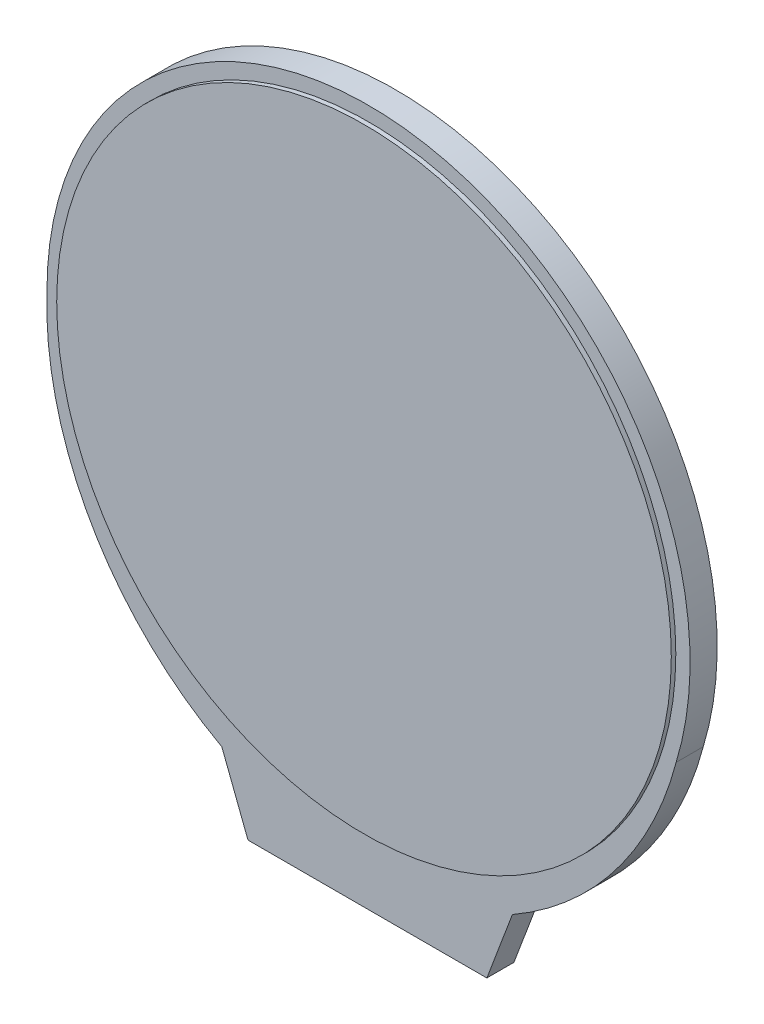
ISO-10303-21;
HEADER;
FILE_DESCRIPTION(('STEP AP214'),'2;1');
FILE_NAME('part.step','',(''),(''),'','','');
FILE_SCHEMA(('AUTOMOTIVE_DESIGN { 1 0 10303 214 1 1 1 1 }'));
ENDSEC;
DATA;
#1=APPLICATION_CONTEXT('core data for automotive mechanical design processes');
#2=APPLICATION_PROTOCOL_DEFINITION('international standard','automotive_design',2000,#1);
#3=PRODUCT_CONTEXT('',#1,'mechanical');
#4=PRODUCT('Part','Part','',(#3));
#5=PRODUCT_RELATED_PRODUCT_CATEGORY('part','',(#4));
#6=PRODUCT_DEFINITION_FORMATION('','',#4);
#7=PRODUCT_DEFINITION_CONTEXT('part definition',#1,'design');
#8=PRODUCT_DEFINITION('design','',#6,#7);
#9=PRODUCT_DEFINITION_SHAPE('','',#8);
#10=(LENGTH_UNIT() NAMED_UNIT(*) SI_UNIT(.MILLI.,.METRE.));
#11=(NAMED_UNIT(*) PLANE_ANGLE_UNIT() SI_UNIT($,.RADIAN.));
#12=(NAMED_UNIT(*) SI_UNIT($,.STERADIAN.) SOLID_ANGLE_UNIT());
#13=UNCERTAINTY_MEASURE_WITH_UNIT(LENGTH_MEASURE(1.E-05),#10,'distance_accuracy_value','');
#14=(GEOMETRIC_REPRESENTATION_CONTEXT(3) GLOBAL_UNCERTAINTY_ASSIGNED_CONTEXT((#13)) GLOBAL_UNIT_ASSIGNED_CONTEXT((#10,
#11,#12)) REPRESENTATION_CONTEXT('',''));
#15=CARTESIAN_POINT('',(0.,0.,0.));
#16=DIRECTION('',(0.,0.,1.));
#17=DIRECTION('',(1.,0.,0.));
#18=AXIS2_PLACEMENT_3D('',#15,#16,#17);
#19=CARTESIAN_POINT('',(-6.59561344745727,-15.5109133790262,-0.25));
#20=DIRECTION('',(-1.,0.,0.));
#21=DIRECTION('',(0.,0.,1.));
#22=AXIS2_PLACEMENT_3D('',#19,#20,#21);
#23=PLANE('',#22);
#24=DIRECTION('',(0.,-1.,0.));
#25=VECTOR('',#24,1.);
#26=CARTESIAN_POINT('',(-6.59561344745727,-15.5109133790262,0.));
#27=LINE('',#26,#25);
#28=CARTESIAN_POINT('',(-6.59561344745727,-8.88871303851563,0.));
#29=VERTEX_POINT('',#28);
#30=CARTESIAN_POINT('',(-6.59561344745727,-15.5109133790262,0.));
#31=VERTEX_POINT('',#30);
#32=EDGE_CURVE('E227',#29,#31,#27,.T.);
#33=ORIENTED_EDGE('',*,*,#32,.F.);
#34=DIRECTION('',(0.,0.,1.));
#35=VECTOR('',#34,1.);
#36=CARTESIAN_POINT('',(-6.59561344745727,-8.88871303851563,-0.25));
#37=LINE('',#36,#35);
#38=CARTESIAN_POINT('',(-6.59561344745727,-8.88871303851563,-0.25));
#39=VERTEX_POINT('',#38);
#40=EDGE_CURVE('E43',#39,#29,#37,.T.);
#41=ORIENTED_EDGE('',*,*,#40,.F.);
#42=DIRECTION('',(0.,-1.,0.));
#43=VECTOR('',#42,1.);
#44=CARTESIAN_POINT('',(-6.59561344745727,-15.5109133790262,-0.25));
#45=LINE('',#44,#43);
#46=CARTESIAN_POINT('',(-6.59561344745727,-15.5109133790262,-0.25));
#47=VERTEX_POINT('',#46);
#48=EDGE_CURVE('E229',#39,#47,#45,.T.);
#49=ORIENTED_EDGE('',*,*,#48,.T.);
#50=DIRECTION('',(0.,0.,1.));
#51=VECTOR('',#50,1.);
#52=CARTESIAN_POINT('',(-6.59561344745727,-15.5109133790262,-0.25));
#53=LINE('',#52,#51);
#54=EDGE_CURVE('E38',#47,#31,#53,.T.);
#55=ORIENTED_EDGE('',*,*,#54,.T.);
#56=EDGE_LOOP('',(#33,#41,#49,#55));
#57=FACE_BOUND('',#56,.T.);
#58=ADVANCED_FACE('F35',(#57),#23,.T.);
#59=CARTESIAN_POINT('',(-6.59561344745727,-8.88871303851563,-0.25));
#60=DIRECTION('',(-0.819117480335174,0.573625795627565,0.));
#61=DIRECTION('',(-0.573625795627565,-0.819117480335174,0.));
#62=AXIS2_PLACEMENT_3D('',#59,#60,#61);
#63=PLANE('',#62);
#64=DIRECTION('',(-0.573625795627565,-0.819117480335174,0.));
#65=VECTOR('',#64,1.);
#66=CARTESIAN_POINT('',(-6.59561344745727,-8.88871303851563,0.));
#67=LINE('',#66,#65);
#68=CARTESIAN_POINT('',(-5.61537471162003,-7.48896656695484,0.));
#69=VERTEX_POINT('',#68);
#70=EDGE_CURVE('E233',#69,#29,#67,.T.);
#71=ORIENTED_EDGE('',*,*,#70,.F.);
#72=DIRECTION('',(0.,0.,1.));
#73=VECTOR('',#72,1.);
#74=CARTESIAN_POINT('',(-5.61537471162003,-7.48896656695484,-0.25));
#75=LINE('',#74,#73);
#76=CARTESIAN_POINT('',(-5.61537471162003,-7.48896656695484,-0.25));
#77=VERTEX_POINT('',#76);
#78=EDGE_CURVE('E274',#77,#69,#75,.T.);
#79=ORIENTED_EDGE('',*,*,#78,.F.);
#80=DIRECTION('',(-0.573625795627565,-0.819117480335174,0.));
#81=VECTOR('',#80,1.);
#82=CARTESIAN_POINT('',(-6.59561344745727,-8.88871303851563,-0.25));
#83=LINE('',#82,#81);
#84=EDGE_CURVE('E251',#77,#39,#83,.T.);
#85=ORIENTED_EDGE('',*,*,#84,.T.);
#86=ORIENTED_EDGE('',*,*,#40,.T.);
#87=EDGE_LOOP('',(#71,#79,#85,#86));
#88=FACE_BOUND('',#87,.T.);
#89=ADVANCED_FACE('F356',(#88),#63,.T.);
#90=CARTESIAN_POINT('',(-5.61537471162003,-7.48896656695484,-0.25));
#91=DIRECTION('',(-1.,0.,0.));
#92=DIRECTION('',(0.,0.,1.));
#93=AXIS2_PLACEMENT_3D('',#90,#91,#92);
#94=PLANE('',#93);
#95=DIRECTION('',(0.,-1.,0.));
#96=VECTOR('',#95,1.);
#97=CARTESIAN_POINT('',(-5.61537471162003,-7.48896656695484,0.));
#98=LINE('',#97,#96);
#99=CARTESIAN_POINT('',(-5.61537471162003,-5.38388285599448,0.));
#100=VERTEX_POINT('',#99);
#101=EDGE_CURVE('E268',#100,#69,#98,.T.);
#102=ORIENTED_EDGE('',*,*,#101,.F.);
#103=DIRECTION('',(0.,0.,1.));
#104=VECTOR('',#103,1.);
#105=CARTESIAN_POINT('',(-5.61537471162003,-5.38388285599448,-0.25));
#106=LINE('',#105,#104);
#107=CARTESIAN_POINT('',(-5.61537471162003,-5.38388285599448,-0.25));
#108=VERTEX_POINT('',#107);
#109=EDGE_CURVE('E276',#108,#100,#106,.T.);
#110=ORIENTED_EDGE('',*,*,#109,.F.);
#111=DIRECTION('',(0.,-1.,0.));
#112=VECTOR('',#111,1.);
#113=CARTESIAN_POINT('',(-5.61537471162003,-7.48896656695484,-0.25));
#114=LINE('',#113,#112);
#115=EDGE_CURVE('E248',#108,#77,#114,.T.);
#116=ORIENTED_EDGE('',*,*,#115,.T.);
#117=ORIENTED_EDGE('',*,*,#78,.T.);
#118=EDGE_LOOP('',(#102,#110,#116,#117));
#119=FACE_BOUND('',#118,.T.);
#120=ADVANCED_FACE('F360',(#119),#94,.T.);
#121=CARTESIAN_POINT('',(-5.11537471162003,-5.38388285599448,-0.25));
#122=DIRECTION('',(0.,0.,1.));
#123=DIRECTION('',(1.,0.,0.));
#124=AXIS2_PLACEMENT_3D('',#121,#122,#123);
#125=CYLINDRICAL_SURFACE('',#124,0.5);
#126=CARTESIAN_POINT('',(-5.11537471162003,-5.38388285599448,0.));
#127=DIRECTION('',(0.,0.,1.));
#128=DIRECTION('',(-1.,0.,0.));
#129=AXIS2_PLACEMENT_3D('',#126,#127,#128);
#130=CIRCLE('',#129,0.5);
#131=CARTESIAN_POINT('',(-5.11537471162003,-4.88388285599448,0.));
#132=VERTEX_POINT('',#131);
#133=EDGE_CURVE('E265',#132,#100,#130,.T.);
#134=ORIENTED_EDGE('',*,*,#133,.F.);
#135=DIRECTION('',(0.,0.,1.));
#136=VECTOR('',#135,1.);
#137=CARTESIAN_POINT('',(-5.11537471162003,-4.88388285599448,-0.25));
#138=LINE('',#137,#136);
#139=CARTESIAN_POINT('',(-5.11537471162003,-4.88388285599448,-0.25));
#140=VERTEX_POINT('',#139);
#141=EDGE_CURVE('E278',#140,#132,#138,.T.);
#142=ORIENTED_EDGE('',*,*,#141,.F.);
#143=CARTESIAN_POINT('',(-5.11537471162003,-5.38388285599448,-0.25));
#144=DIRECTION('',(0.,0.,1.));
#145=DIRECTION('',(-1.,0.,0.));
#146=AXIS2_PLACEMENT_3D('',#143,#144,#145);
#147=CIRCLE('',#146,0.5);
#148=EDGE_CURVE('E245',#140,#108,#147,.T.);
#149=ORIENTED_EDGE('',*,*,#148,.T.);
#150=ORIENTED_EDGE('',*,*,#109,.T.);
#151=EDGE_LOOP('',(#134,#142,#149,#150));
#152=FACE_BOUND('',#151,.T.);
#153=ADVANCED_FACE('F366',(#152),#125,.T.);
#154=CARTESIAN_POINT('',(-5.11537471162003,-4.88388285599448,-0.25));
#155=DIRECTION('',(0.,1.,0.));
#156=DIRECTION('',(0.,0.,1.));
#157=AXIS2_PLACEMENT_3D('',#154,#155,#156);
#158=PLANE('',#157);
#159=DIRECTION('',(-1.,0.,0.));
#160=VECTOR('',#159,1.);
#161=CARTESIAN_POINT('',(-5.11537471162003,-4.88388285599448,-0.25));
#162=LINE('',#161,#160);
#163=CARTESIAN_POINT('',(5.40337229393232,-4.88388285599448,-0.25));
#164=VERTEX_POINT('',#163);
#165=CARTESIAN_POINT('',(4.29949612860225,-4.88388285599448,-0.25));
#166=VERTEX_POINT('',#165);
#167=EDGE_CURVE('E242',#164,#166,#162,.T.);
#168=ORIENTED_EDGE('',*,*,#167,.T.);
#169=DIRECTION('',(0.,0.,1.));
#170=VECTOR('',#169,1.);
#171=CARTESIAN_POINT('',(4.29949612860225,-4.88388285599448,-0.26));
#172=LINE('',#171,#170);
#173=CARTESIAN_POINT('',(4.29949612860225,-4.88388285599448,-0.26));
#174=VERTEX_POINT('',#173);
#175=EDGE_CURVE('E207',#174,#166,#172,.T.);
#176=ORIENTED_EDGE('',*,*,#175,.F.);
#177=DIRECTION('',(-1.,0.,0.));
#178=VECTOR('',#177,1.);
#179=CARTESIAN_POINT('',(-4.01149854628996,-4.88388285599448,-0.26));
#180=LINE('',#179,#178);
#181=CARTESIAN_POINT('',(-4.01149854628996,-4.88388285599448,-0.26));
#182=VERTEX_POINT('',#181);
#183=EDGE_CURVE('E200',#174,#182,#180,.T.);
#184=ORIENTED_EDGE('',*,*,#183,.T.);
#185=DIRECTION('',(0.,0.,1.));
#186=VECTOR('',#185,1.);
#187=CARTESIAN_POINT('',(-4.01149854628996,-4.88388285599448,-0.26));
#188=LINE('',#187,#186);
#189=CARTESIAN_POINT('',(-4.01149854628996,-4.88388285599448,-0.25));
#190=VERTEX_POINT('',#189);
#191=EDGE_CURVE('E204',#182,#190,#188,.T.);
#192=ORIENTED_EDGE('',*,*,#191,.T.);
#193=EDGE_CURVE('E57',#190,#140,#162,.T.);
#194=ORIENTED_EDGE('',*,*,#193,.T.);
#195=ORIENTED_EDGE('',*,*,#141,.T.);
#196=DIRECTION('',(-1.,0.,0.));
#197=VECTOR('',#196,1.);
#198=CARTESIAN_POINT('',(-5.11537471162003,-4.88388285599448,0.));
#199=LINE('',#198,#197);
#200=CARTESIAN_POINT('',(5.40337229393232,-4.88388285599448,0.));
#201=VERTEX_POINT('',#200);
#202=EDGE_CURVE('E262',#201,#132,#199,.T.);
#203=ORIENTED_EDGE('',*,*,#202,.F.);
#204=DIRECTION('',(0.,0.,1.));
#205=VECTOR('',#204,1.);
#206=CARTESIAN_POINT('',(5.40337229393232,-4.88388285599448,-0.25));
#207=LINE('',#206,#205);
#208=EDGE_CURVE('E280',#164,#201,#207,.T.);
#209=ORIENTED_EDGE('',*,*,#208,.F.);
#210=EDGE_LOOP('',(#168,#176,#184,#192,#194,#195,#203,#209));
#211=FACE_BOUND('',#210,.T.);
#212=ADVANCED_FACE('F375',(#211),#158,.T.);
#213=CARTESIAN_POINT('',(5.40337229393232,-5.38388285599448,-0.25));
#214=DIRECTION('',(0.,0.,1.));
#215=DIRECTION('',(1.,0.,0.));
#216=AXIS2_PLACEMENT_3D('',#213,#214,#215);
#217=CYLINDRICAL_SURFACE('',#216,0.5);
#218=CARTESIAN_POINT('',(5.40337229393232,-5.38388285599448,0.));
#219=DIRECTION('',(0.,0.,1.));
#220=DIRECTION('',(-1.,0.,0.));
#221=AXIS2_PLACEMENT_3D('',#218,#219,#220);
#222=CIRCLE('',#221,0.5);
#223=CARTESIAN_POINT('',(5.90337229393232,-5.38388285599448,0.));
#224=VERTEX_POINT('',#223);
#225=EDGE_CURVE('E259',#224,#201,#222,.T.);
#226=ORIENTED_EDGE('',*,*,#225,.F.);
#227=DIRECTION('',(0.,0.,1.));
#228=VECTOR('',#227,1.);
#229=CARTESIAN_POINT('',(5.90337229393232,-5.38388285599448,-0.25));
#230=LINE('',#229,#228);
#231=CARTESIAN_POINT('',(5.90337229393232,-5.38388285599448,-0.25));
#232=VERTEX_POINT('',#231);
#233=EDGE_CURVE('E283',#232,#224,#230,.T.);
#234=ORIENTED_EDGE('',*,*,#233,.F.);
#235=CARTESIAN_POINT('',(5.40337229393232,-5.38388285599448,-0.25));
#236=DIRECTION('',(0.,0.,1.));
#237=DIRECTION('',(-1.,0.,0.));
#238=AXIS2_PLACEMENT_3D('',#235,#236,#237);
#239=CIRCLE('',#238,0.5);
#240=EDGE_CURVE('E239',#232,#164,#239,.T.);
#241=ORIENTED_EDGE('',*,*,#240,.T.);
#242=ORIENTED_EDGE('',*,*,#208,.T.);
#243=EDGE_LOOP('',(#226,#234,#241,#242));
#244=FACE_BOUND('',#243,.T.);
#245=ADVANCED_FACE('F379',(#244),#217,.T.);
#246=CARTESIAN_POINT('',(5.90337229393232,-15.5109133790262,-0.25));
#247=DIRECTION('',(1.,0.,0.));
#248=DIRECTION('',(0.,0.,-1.));
#249=AXIS2_PLACEMENT_3D('',#246,#247,#248);
#250=PLANE('',#249);
#251=DIRECTION('',(0.,1.,0.));
#252=VECTOR('',#251,1.);
#253=CARTESIAN_POINT('',(5.90337229393232,-15.5109133790262,0.));
#254=LINE('',#253,#252);
#255=CARTESIAN_POINT('',(5.90337229393232,-15.5109133790262,0.));
#256=VERTEX_POINT('',#255);
#257=EDGE_CURVE('E256',#256,#224,#254,.T.);
#258=ORIENTED_EDGE('',*,*,#257,.F.);
#259=DIRECTION('',(0.,0.,1.));
#260=VECTOR('',#259,1.);
#261=CARTESIAN_POINT('',(5.90337229393232,-15.5109133790262,-0.25));
#262=LINE('',#261,#260);
#263=CARTESIAN_POINT('',(5.90337229393232,-15.5109133790262,-0.25));
#264=VERTEX_POINT('',#263);
#265=EDGE_CURVE('E284',#264,#256,#262,.T.);
#266=ORIENTED_EDGE('',*,*,#265,.F.);
#267=DIRECTION('',(0.,1.,0.));
#268=VECTOR('',#267,1.);
#269=CARTESIAN_POINT('',(5.90337229393232,-15.5109133790262,-0.25));
#270=LINE('',#269,#268);
#271=EDGE_CURVE('E236',#264,#232,#270,.T.);
#272=ORIENTED_EDGE('',*,*,#271,.T.);
#273=ORIENTED_EDGE('',*,*,#233,.T.);
#274=EDGE_LOOP('',(#258,#266,#272,#273));
#275=FACE_BOUND('',#274,.T.);
#276=ADVANCED_FACE('F383',(#275),#250,.T.);
#277=CARTESIAN_POINT('',(-6.59561344745727,-15.5109133790262,-0.25));
#278=DIRECTION('',(0.,-1.,0.));
#279=DIRECTION('',(0.,0.,-1.));
#280=AXIS2_PLACEMENT_3D('',#277,#278,#279);
#281=PLANE('',#280);
#282=ORIENTED_EDGE('',*,*,#265,.T.);
#283=DIRECTION('',(1.,0.,0.));
#284=VECTOR('',#283,1.);
#285=CARTESIAN_POINT('',(6.62614800317624,-15.5109133790262,0.));
#286=LINE('',#285,#284);
#287=CARTESIAN_POINT('',(6.62614800317624,-15.5109133790262,0.));
#288=VERTEX_POINT('',#287);
#289=EDGE_CURVE('E180',#256,#288,#286,.T.);
#290=ORIENTED_EDGE('',*,*,#289,.T.);
#291=DIRECTION('',(0.,0.,-1.));
#292=VECTOR('',#291,1.);
#293=CARTESIAN_POINT('',(6.62614800317624,-15.5109133790262,1.5));
#294=LINE('',#293,#292);
#295=CARTESIAN_POINT('',(6.62614800317624,-15.5109133790262,1.5));
#296=VERTEX_POINT('',#295);
#297=EDGE_CURVE('E161',#296,#288,#294,.T.);
#298=ORIENTED_EDGE('',*,*,#297,.F.);
#299=DIRECTION('',(1.,0.,0.));
#300=VECTOR('',#299,1.);
#301=CARTESIAN_POINT('',(6.62614800317624,-15.5109133790262,1.5));
#302=LINE('',#301,#300);
#303=CARTESIAN_POINT('',(-6.59561344745727,-15.5109133790262,1.5));
#304=VERTEX_POINT('',#303);
#305=EDGE_CURVE('E167',#304,#296,#302,.T.);
#306=ORIENTED_EDGE('',*,*,#305,.F.);
#307=DIRECTION('',(0.,0.,-1.));
#308=VECTOR('',#307,1.);
#309=CARTESIAN_POINT('',(-6.59561344745727,-15.5109133790262,1.5));
#310=LINE('',#309,#308);
#311=EDGE_CURVE('E299',#304,#31,#310,.T.);
#312=ORIENTED_EDGE('',*,*,#311,.T.);
#313=ORIENTED_EDGE('',*,*,#54,.F.);
#314=DIRECTION('',(1.,0.,0.));
#315=VECTOR('',#314,1.);
#316=CARTESIAN_POINT('',(-6.59561344745727,-15.5109133790262,-0.25));
#317=LINE('',#316,#315);
#318=EDGE_CURVE('E232',#47,#264,#317,.T.);
#319=ORIENTED_EDGE('',*,*,#318,.T.);
#320=EDGE_LOOP('',(#282,#290,#298,#306,#312,#313,#319));
#321=FACE_BOUND('',#320,.T.);
#322=ADVANCED_FACE('F178',(#321),#281,.T.);
#323=CARTESIAN_POINT('',(-5.11537471162003,-5.38388285599448,-0.25));
#324=DIRECTION('',(0.,0.,-1.));
#325=DIRECTION('',(-1.,0.,0.));
#326=AXIS2_PLACEMENT_3D('',#323,#324,#325);
#327=PLANE('',#326);
#328=DIRECTION('',(0.,1.,0.));
#329=VECTOR('',#328,1.);
#330=CARTESIAN_POINT('',(-4.01149854628996,-5.38388285599448,-0.25));
#331=LINE('',#330,#329);
#332=CARTESIAN_POINT('',(-4.01149854628996,-7.00294348655179,-0.25));
#333=VERTEX_POINT('',#332);
#334=EDGE_CURVE('E218',#333,#190,#331,.T.);
#335=ORIENTED_EDGE('',*,*,#334,.F.);
#336=DIRECTION('',(-1.,0.,0.));
#337=VECTOR('',#336,1.);
#338=CARTESIAN_POINT('',(-5.11537471162003,-7.00294348655179,-0.25));
#339=LINE('',#338,#337);
#340=CARTESIAN_POINT('',(4.29949612860225,-7.00294348655179,-0.25));
#341=VERTEX_POINT('',#340);
#342=EDGE_CURVE('E51',#341,#333,#339,.T.);
#343=ORIENTED_EDGE('',*,*,#342,.F.);
#344=DIRECTION('',(0.,-1.,0.));
#345=VECTOR('',#344,1.);
#346=CARTESIAN_POINT('',(4.29949612860225,-5.38388285599448,-0.25));
#347=LINE('',#346,#345);
#348=EDGE_CURVE('E216',#166,#341,#347,.T.);
#349=ORIENTED_EDGE('',*,*,#348,.F.);
#350=ORIENTED_EDGE('',*,*,#167,.F.);
#351=ORIENTED_EDGE('',*,*,#240,.F.);
#352=ORIENTED_EDGE('',*,*,#271,.F.);
#353=ORIENTED_EDGE('',*,*,#318,.F.);
#354=ORIENTED_EDGE('',*,*,#48,.F.);
#355=ORIENTED_EDGE('',*,*,#84,.F.);
#356=ORIENTED_EDGE('',*,*,#115,.F.);
#357=ORIENTED_EDGE('',*,*,#148,.F.);
#358=ORIENTED_EDGE('',*,*,#193,.F.);
#359=EDGE_LOOP('',(#335,#343,#349,#350,#351,#352,#353,#354,#355,#356,#357,#358));
#360=FACE_BOUND('',#359,.T.);
#361=CARTESIAN_POINT('',(4.73691690096499,-9.19004734836553,-0.25));
#362=DIRECTION('',(0.,0.,1.));
#363=DIRECTION('',(1.,0.,0.));
#364=AXIS2_PLACEMENT_3D('',#361,#362,#363);
#365=CIRCLE('',#364,0.60274700542161);
#366=CARTESIAN_POINT('',(5.3396639063866,-9.19004734836553,-0.25));
#367=VERTEX_POINT('',#366);
#368=EDGE_CURVE('E220',#367,#367,#365,.T.);
#369=ORIENTED_EDGE('',*,*,#368,.T.);
#370=EDGE_LOOP('',(#369));
#371=FACE_BOUND('',#370,.T.);
#372=CARTESIAN_POINT('',(-5.23627670890565,-9.19004734836553,-0.25));
#373=DIRECTION('',(0.,0.,1.));
#374=DIRECTION('',(1.,0.,0.));
#375=AXIS2_PLACEMENT_3D('',#372,#373,#374);
#376=CIRCLE('',#375,0.598025676800162);
#377=CARTESIAN_POINT('',(-4.63825103210549,-9.19004734836553,-0.25));
#378=VERTEX_POINT('',#377);
#379=EDGE_CURVE('E223',#378,#378,#376,.T.);
#380=ORIENTED_EDGE('',*,*,#379,.T.);
#381=EDGE_LOOP('',(#380));
#382=FACE_BOUND('',#381,.T.);
#383=ADVANCED_FACE('F370',(#360,#371,#382),#327,.T.);
#384=CARTESIAN_POINT('',(-5.23627670890565,-9.19004734836553,-0.25));
#385=DIRECTION('',(0.,0.,1.));
#386=DIRECTION('',(1.,0.,0.));
#387=AXIS2_PLACEMENT_3D('',#384,#385,#386);
#388=CYLINDRICAL_SURFACE('',#387,0.598025676800162);
#389=ORIENTED_EDGE('',*,*,#379,.F.);
#390=EDGE_LOOP('',(#389));
#391=FACE_BOUND('',#390,.T.);
#392=CARTESIAN_POINT('',(-5.23627670890565,-9.19004734836553,0.));
#393=DIRECTION('',(0.,0.,1.));
#394=DIRECTION('',(1.,0.,0.));
#395=AXIS2_PLACEMENT_3D('',#392,#393,#394);
#396=CIRCLE('',#395,0.598025676800162);
#397=CARTESIAN_POINT('',(-4.63825103210549,-9.19004734836553,0.));
#398=VERTEX_POINT('',#397);
#399=EDGE_CURVE('E182',#398,#398,#396,.T.);
#400=ORIENTED_EDGE('',*,*,#399,.T.);
#401=EDGE_LOOP('',(#400));
#402=FACE_BOUND('',#401,.T.);
#403=ADVANCED_FACE('F391',(#391,#402),#388,.F.);
#404=CARTESIAN_POINT('',(4.73691690096499,-9.19004734836553,-0.25));
#405=DIRECTION('',(0.,0.,1.));
#406=DIRECTION('',(1.,0.,0.));
#407=AXIS2_PLACEMENT_3D('',#404,#405,#406);
#408=CYLINDRICAL_SURFACE('',#407,0.60274700542161);
#409=ORIENTED_EDGE('',*,*,#368,.F.);
#410=EDGE_LOOP('',(#409));
#411=FACE_BOUND('',#410,.T.);
#412=CARTESIAN_POINT('',(4.73691690096499,-9.19004734836553,0.));
#413=DIRECTION('',(0.,0.,1.));
#414=DIRECTION('',(1.,0.,0.));
#415=AXIS2_PLACEMENT_3D('',#412,#413,#414);
#416=CIRCLE('',#415,0.60274700542161);
#417=CARTESIAN_POINT('',(5.3396639063866,-9.19004734836553,0.));
#418=VERTEX_POINT('',#417);
#419=EDGE_CURVE('E185',#418,#418,#416,.T.);
#420=ORIENTED_EDGE('',*,*,#419,.T.);
#421=EDGE_LOOP('',(#420));
#422=FACE_BOUND('',#421,.T.);
#423=ADVANCED_FACE('F395',(#411,#422),#408,.F.);
#424=CARTESIAN_POINT('',(-4.01149854628996,-7.00294348655179,-0.26));
#425=DIRECTION('',(-1.,0.,0.));
#426=DIRECTION('',(0.,0.,1.));
#427=AXIS2_PLACEMENT_3D('',#424,#425,#426);
#428=PLANE('',#427);
#429=DIRECTION('',(0.,0.,1.));
#430=VECTOR('',#429,1.);
#431=CARTESIAN_POINT('',(-4.01149854628996,-7.00294348655179,-0.26));
#432=LINE('',#431,#430);
#433=CARTESIAN_POINT('',(-4.01149854628996,-7.00294348655179,-0.26));
#434=VERTEX_POINT('',#433);
#435=EDGE_CURVE('E203',#434,#333,#432,.T.);
#436=ORIENTED_EDGE('',*,*,#435,.T.);
#437=ORIENTED_EDGE('',*,*,#334,.T.);
#438=ORIENTED_EDGE('',*,*,#191,.F.);
#439=DIRECTION('',(0.,-1.,0.));
#440=VECTOR('',#439,1.);
#441=CARTESIAN_POINT('',(-4.01149854628996,-7.00294348655179,-0.26));
#442=LINE('',#441,#440);
#443=EDGE_CURVE('E191',#182,#434,#442,.T.);
#444=ORIENTED_EDGE('',*,*,#443,.T.);
#445=EDGE_LOOP('',(#436,#437,#438,#444));
#446=FACE_BOUND('',#445,.T.);
#447=ADVANCED_FACE('F431',(#446),#428,.T.);
#448=CARTESIAN_POINT('',(4.29949612860225,-7.00294348655179,-0.26));
#449=DIRECTION('',(1.,0.,0.));
#450=DIRECTION('',(0.,0.,-1.));
#451=AXIS2_PLACEMENT_3D('',#448,#449,#450);
#452=PLANE('',#451);
#453=ORIENTED_EDGE('',*,*,#175,.T.);
#454=ORIENTED_EDGE('',*,*,#348,.T.);
#455=DIRECTION('',(0.,0.,1.));
#456=VECTOR('',#455,1.);
#457=CARTESIAN_POINT('',(4.29949612860225,-7.00294348655179,-0.26));
#458=LINE('',#457,#456);
#459=CARTESIAN_POINT('',(4.29949612860225,-7.00294348655179,-0.26));
#460=VERTEX_POINT('',#459);
#461=EDGE_CURVE('E210',#460,#341,#458,.T.);
#462=ORIENTED_EDGE('',*,*,#461,.F.);
#463=DIRECTION('',(0.,1.,0.));
#464=VECTOR('',#463,1.);
#465=CARTESIAN_POINT('',(4.29949612860225,-7.00294348655179,-0.26));
#466=LINE('',#465,#464);
#467=EDGE_CURVE('E197',#460,#174,#466,.T.);
#468=ORIENTED_EDGE('',*,*,#467,.T.);
#469=EDGE_LOOP('',(#453,#454,#462,#468));
#470=FACE_BOUND('',#469,.T.);
#471=ADVANCED_FACE('F428',(#470),#452,.T.);
#472=CARTESIAN_POINT('',(-4.01149854628996,-7.00294348655179,-0.26));
#473=DIRECTION('',(0.,-1.,0.));
#474=DIRECTION('',(0.,0.,-1.));
#475=AXIS2_PLACEMENT_3D('',#472,#473,#474);
#476=PLANE('',#475);
#477=ORIENTED_EDGE('',*,*,#461,.T.);
#478=ORIENTED_EDGE('',*,*,#342,.T.);
#479=ORIENTED_EDGE('',*,*,#435,.F.);
#480=DIRECTION('',(1.,0.,0.));
#481=VECTOR('',#480,1.);
#482=CARTESIAN_POINT('',(-4.01149854628996,-7.00294348655179,-0.26));
#483=LINE('',#482,#481);
#484=EDGE_CURVE('E194',#434,#460,#483,.T.);
#485=ORIENTED_EDGE('',*,*,#484,.T.);
#486=EDGE_LOOP('',(#477,#478,#479,#485));
#487=FACE_BOUND('',#486,.T.);
#488=ADVANCED_FACE('F413',(#487),#476,.T.);
#489=CARTESIAN_POINT('',(0.,0.,-0.26));
#490=DIRECTION('',(0.,0.,-1.));
#491=DIRECTION('',(-1.,0.,0.));
#492=AXIS2_PLACEMENT_3D('',#489,#490,#491);
#493=PLANE('',#492);
#494=ORIENTED_EDGE('',*,*,#443,.F.);
#495=ORIENTED_EDGE('',*,*,#183,.F.);
#496=ORIENTED_EDGE('',*,*,#467,.F.);
#497=ORIENTED_EDGE('',*,*,#484,.F.);
#498=EDGE_LOOP('',(#494,#495,#496,#497));
#499=FACE_BOUND('',#498,.T.);
#500=ADVANCED_FACE('F407',(#499),#493,.T.);
#501=CARTESIAN_POINT('',(0.877354189916062,4.57255086571906,0.));
#502=DIRECTION('',(0.,0.,1.));
#503=DIRECTION('',(1.,0.,0.));
#504=AXIS2_PLACEMENT_3D('',#501,#502,#503);
#505=PLANE('',#504);
#506=ORIENTED_EDGE('',*,*,#399,.F.);
#507=EDGE_LOOP('',(#506));
#508=FACE_BOUND('',#507,.T.);
#509=ADVANCED_FACE('F404',(#508),#505,.F.);
#510=ORIENTED_EDGE('',*,*,#419,.F.);
#511=EDGE_LOOP('',(#510));
#512=FACE_BOUND('',#511,.T.);
#513=ADVANCED_FACE('F406',(#512),#505,.F.);
#514=ORIENTED_EDGE('',*,*,#70,.T.);
#515=ORIENTED_EDGE('',*,*,#32,.T.);
#516=DIRECTION('',(0.360315719825667,-0.932830414409024,0.));
#517=VECTOR('',#516,1.);
#518=CARTESIAN_POINT('',(-6.59561344745727,-15.5109133790262,0.));
#519=LINE('',#518,#517);
#520=CARTESIAN_POINT('',(-8.0437254229256,-11.7618599243494,0.));
#521=VERTEX_POINT('',#520);
#522=EDGE_CURVE('E176',#521,#31,#519,.T.);
#523=ORIENTED_EDGE('',*,*,#522,.F.);
#524=CARTESIAN_POINT('',(0.877354189916062,4.57255086571906,0.));
#525=DIRECTION('',(0.,0.,1.));
#526=DIRECTION('',(1.,0.,0.));
#527=AXIS2_PLACEMENT_3D('',#524,#525,#526);
#528=CIRCLE('',#527,18.6117875905933);
#529=CARTESIAN_POINT('',(-17.7239775774704,5.19632470052144,0.));
#530=VERTEX_POINT('',#529);
#531=EDGE_CURVE('E302',#530,#521,#528,.T.);
#532=ORIENTED_EDGE('',*,*,#531,.F.);
#533=CARTESIAN_POINT('',(0.0759376200435077,5.25126977594922,0.));
#534=DIRECTION('',(0.,0.,1.));
#535=DIRECTION('',(1.,0.,0.));
#536=AXIS2_PLACEMENT_3D('',#533,#534,#535);
#537=CIRCLE('',#536,17.8);
#538=CARTESIAN_POINT('',(17.1032682010663,0.0637835557685375,0.));
#539=VERTEX_POINT('',#538);
#540=EDGE_CURVE('E319',#539,#530,#537,.T.);
#541=ORIENTED_EDGE('',*,*,#540,.F.);
#542=CARTESIAN_POINT('',(-1.5233543091872,4.95396862172633,0.));
#543=DIRECTION('',(0.,0.,1.));
#544=DIRECTION('',(-1.,0.,0.));
#545=AXIS2_PLACEMENT_3D('',#542,#543,#544);
#546=CIRCLE('',#545,19.2578549199749);
#547=CARTESIAN_POINT('',(8.03938860992341,-11.7618599243494,0.));
#548=VERTEX_POINT('',#547);
#549=EDGE_CURVE('E323',#548,#539,#546,.T.);
#550=ORIENTED_EDGE('',*,*,#549,.F.);
#551=DIRECTION('',(0.352730267805649,0.935725044109516,0.));
#552=VECTOR('',#551,1.);
#553=CARTESIAN_POINT('',(6.62614800317624,-15.5109133790262,0.));
#554=LINE('',#553,#552);
#555=EDGE_CURVE('E325',#288,#548,#554,.T.);
#556=ORIENTED_EDGE('',*,*,#555,.F.);
#557=ORIENTED_EDGE('',*,*,#289,.F.);
#558=ORIENTED_EDGE('',*,*,#257,.T.);
#559=ORIENTED_EDGE('',*,*,#225,.T.);
#560=ORIENTED_EDGE('',*,*,#202,.T.);
#561=ORIENTED_EDGE('',*,*,#133,.T.);
#562=ORIENTED_EDGE('',*,*,#101,.T.);
#563=EDGE_LOOP('',(#514,#515,#523,#532,#541,#550,#556,#557,#558,#559,#560,#561,#562));
#564=FACE_BOUND('',#563,.T.);
#565=ADVANCED_FACE('F293',(#564),#505,.F.);
#566=CARTESIAN_POINT('',(6.62614800317624,-15.5109133790262,1.5));
#567=DIRECTION('',(-0.935725044109516,0.352730267805649,0.));
#568=DIRECTION('',(-0.352730267805649,-0.935725044109516,0.));
#569=AXIS2_PLACEMENT_3D('',#566,#567,#568);
#570=PLANE('',#569);
#571=ORIENTED_EDGE('',*,*,#555,.T.);
#572=DIRECTION('',(0.,0.,-1.));
#573=VECTOR('',#572,1.);
#574=CARTESIAN_POINT('',(8.03938860992341,-11.7618599243494,1.5));
#575=LINE('',#574,#573);
#576=CARTESIAN_POINT('',(8.03938860992341,-11.7618599243494,1.5));
#577=VERTEX_POINT('',#576);
#578=EDGE_CURVE('E163',#577,#548,#575,.T.);
#579=ORIENTED_EDGE('',*,*,#578,.F.);
#580=DIRECTION('',(0.352730267805649,0.935725044109516,0.));
#581=VECTOR('',#580,1.);
#582=CARTESIAN_POINT('',(6.62614800317624,-15.5109133790262,1.5));
#583=LINE('',#582,#581);
#584=EDGE_CURVE('E157',#296,#577,#583,.T.);
#585=ORIENTED_EDGE('',*,*,#584,.F.);
#586=ORIENTED_EDGE('',*,*,#297,.T.);
#587=EDGE_LOOP('',(#571,#579,#585,#586));
#588=FACE_BOUND('',#587,.T.);
#589=ADVANCED_FACE('F159',(#588),#570,.F.);
#590=CARTESIAN_POINT('',(-1.5233543091872,4.95396862172633,1.5));
#591=DIRECTION('',(0.,0.,-1.));
#592=DIRECTION('',(-1.,0.,0.));
#593=AXIS2_PLACEMENT_3D('',#590,#591,#592);
#594=CYLINDRICAL_SURFACE('',#593,19.2578549199749);
#595=ORIENTED_EDGE('',*,*,#549,.T.);
#596=DIRECTION('',(0.,0.,-1.));
#597=VECTOR('',#596,1.);
#598=CARTESIAN_POINT('',(17.1032682010663,0.0637835557685375,1.5));
#599=LINE('',#598,#597);
#600=CARTESIAN_POINT('',(17.1032682010663,0.0637835557685375,1.5));
#601=VERTEX_POINT('',#600);
#602=EDGE_CURVE('E187',#601,#539,#599,.T.);
#603=ORIENTED_EDGE('',*,*,#602,.F.);
#604=CARTESIAN_POINT('',(-1.5233543091872,4.95396862172633,1.5));
#605=DIRECTION('',(0.,0.,1.));
#606=DIRECTION('',(-1.,0.,0.));
#607=AXIS2_PLACEMENT_3D('',#604,#605,#606);
#608=CIRCLE('',#607,19.2578549199749);
#609=EDGE_CURVE('E166',#577,#601,#608,.T.);
#610=ORIENTED_EDGE('',*,*,#609,.F.);
#611=ORIENTED_EDGE('',*,*,#578,.T.);
#612=EDGE_LOOP('',(#595,#603,#610,#611));
#613=FACE_BOUND('',#612,.T.);
#614=ADVANCED_FACE('F420',(#613),#594,.T.);
#615=CARTESIAN_POINT('',(0.0759376200435077,5.25126977594922,1.5));
#616=DIRECTION('',(0.,0.,-1.));
#617=DIRECTION('',(-1.,0.,0.));
#618=AXIS2_PLACEMENT_3D('',#615,#616,#617);
#619=CYLINDRICAL_SURFACE('',#618,17.8);
#620=ORIENTED_EDGE('',*,*,#540,.T.);
#621=DIRECTION('',(0.,0.,-1.));
#622=VECTOR('',#621,1.);
#623=CARTESIAN_POINT('',(-17.7239775774704,5.19632470052144,1.5));
#624=LINE('',#623,#622);
#625=CARTESIAN_POINT('',(-17.7239775774704,5.19632470052144,1.5));
#626=VERTEX_POINT('',#625);
#627=EDGE_CURVE('E305',#626,#530,#624,.T.);
#628=ORIENTED_EDGE('',*,*,#627,.F.);
#629=CARTESIAN_POINT('',(0.0759376200435077,5.25126977594922,1.5));
#630=DIRECTION('',(0.,0.,1.));
#631=DIRECTION('',(1.,0.,0.));
#632=AXIS2_PLACEMENT_3D('',#629,#630,#631);
#633=CIRCLE('',#632,17.8);
#634=EDGE_CURVE('E320',#601,#626,#633,.T.);
#635=ORIENTED_EDGE('',*,*,#634,.F.);
#636=ORIENTED_EDGE('',*,*,#602,.T.);
#637=EDGE_LOOP('',(#620,#628,#635,#636));
#638=FACE_BOUND('',#637,.T.);
#639=ADVANCED_FACE('F317',(#638),#619,.T.);
#640=CARTESIAN_POINT('',(0.877354189916062,4.57255086571906,1.5));
#641=DIRECTION('',(0.,0.,-1.));
#642=DIRECTION('',(-1.,0.,0.));
#643=AXIS2_PLACEMENT_3D('',#640,#641,#642);
#644=CYLINDRICAL_SURFACE('',#643,18.6117875905933);
#645=ORIENTED_EDGE('',*,*,#531,.T.);
#646=DIRECTION('',(0.,0.,-1.));
#647=VECTOR('',#646,1.);
#648=CARTESIAN_POINT('',(-8.0437254229256,-11.7618599243494,1.5));
#649=LINE('',#648,#647);
#650=CARTESIAN_POINT('',(-8.0437254229256,-11.7618599243494,1.5));
#651=VERTEX_POINT('',#650);
#652=EDGE_CURVE('E301',#651,#521,#649,.T.);
#653=ORIENTED_EDGE('',*,*,#652,.F.);
#654=CARTESIAN_POINT('',(0.877354189916062,4.57255086571906,1.5));
#655=DIRECTION('',(0.,0.,1.));
#656=DIRECTION('',(1.,0.,0.));
#657=AXIS2_PLACEMENT_3D('',#654,#655,#656);
#658=CIRCLE('',#657,18.6117875905933);
#659=EDGE_CURVE('E307',#626,#651,#658,.T.);
#660=ORIENTED_EDGE('',*,*,#659,.F.);
#661=ORIENTED_EDGE('',*,*,#627,.T.);
#662=EDGE_LOOP('',(#645,#653,#660,#661));
#663=FACE_BOUND('',#662,.T.);
#664=ADVANCED_FACE('F352',(#663),#644,.T.);
#665=CARTESIAN_POINT('',(-6.59561344745727,-15.5109133790262,1.5));
#666=DIRECTION('',(0.932830414409024,0.360315719825667,0.));
#667=DIRECTION('',(-0.360315719825667,0.932830414409024,0.));
#668=AXIS2_PLACEMENT_3D('',#665,#666,#667);
#669=PLANE('',#668);
#670=ORIENTED_EDGE('',*,*,#522,.T.);
#671=ORIENTED_EDGE('',*,*,#311,.F.);
#672=DIRECTION('',(0.360315719825667,-0.932830414409024,0.));
#673=VECTOR('',#672,1.);
#674=CARTESIAN_POINT('',(-6.59561344745727,-15.5109133790262,1.5));
#675=LINE('',#674,#673);
#676=EDGE_CURVE('E172',#651,#304,#675,.T.);
#677=ORIENTED_EDGE('',*,*,#676,.F.);
#678=ORIENTED_EDGE('',*,*,#652,.T.);
#679=EDGE_LOOP('',(#670,#671,#677,#678));
#680=FACE_BOUND('',#679,.T.);
#681=ADVANCED_FACE('F298',(#680),#669,.F.);
#682=CARTESIAN_POINT('',(0.877354189916062,4.57255086571906,1.5));
#683=DIRECTION('',(0.,0.,1.));
#684=DIRECTION('',(1.,0.,0.));
#685=AXIS2_PLACEMENT_3D('',#682,#683,#684);
#686=PLANE('',#685);
#687=CARTESIAN_POINT('',(0.0759376200435077,5.25126977594922,1.5));
#688=DIRECTION('',(0.,0.,1.));
#689=DIRECTION('',(1.,0.,0.));
#690=AXIS2_PLACEMENT_3D('',#687,#688,#689);
#691=CIRCLE('',#690,17.0106218316418);
#692=CARTESIAN_POINT('',(17.0865594516853,5.25126977594922,1.5));
#693=VERTEX_POINT('',#692);
#694=EDGE_CURVE('E11',#693,#693,#691,.T.);
#695=ORIENTED_EDGE('',*,*,#694,.F.);
#696=EDGE_LOOP('',(#695));
#697=FACE_BOUND('',#696,.T.);
#698=ORIENTED_EDGE('',*,*,#305,.T.);
#699=ORIENTED_EDGE('',*,*,#584,.T.);
#700=ORIENTED_EDGE('',*,*,#609,.T.);
#701=ORIENTED_EDGE('',*,*,#634,.T.);
#702=ORIENTED_EDGE('',*,*,#659,.T.);
#703=ORIENTED_EDGE('',*,*,#676,.T.);
#704=EDGE_LOOP('',(#698,#699,#700,#701,#702,#703));
#705=FACE_BOUND('',#704,.T.);
#706=ADVANCED_FACE('F170',(#697,#705),#686,.T.);
#707=CARTESIAN_POINT('',(0.0759376200435077,5.25126977594922,1.75));
#708=DIRECTION('',(0.,0.,-1.));
#709=DIRECTION('',(-1.,0.,0.));
#710=AXIS2_PLACEMENT_3D('',#707,#708,#709);
#711=CYLINDRICAL_SURFACE('',#710,17.0106218316418);
#712=CARTESIAN_POINT('',(0.0759376200435077,5.25126977594922,1.75));
#713=DIRECTION('',(0.,0.,1.));
#714=DIRECTION('',(1.,0.,0.));
#715=AXIS2_PLACEMENT_3D('',#712,#713,#714);
#716=CIRCLE('',#715,17.0106218316418);
#717=CARTESIAN_POINT('',(17.0865594516853,5.25126977594922,1.75));
#718=VERTEX_POINT('',#717);
#719=EDGE_CURVE('E329',#718,#718,#716,.T.);
#720=ORIENTED_EDGE('',*,*,#719,.F.);
#721=EDGE_LOOP('',(#720));
#722=FACE_BOUND('',#721,.T.);
#723=ORIENTED_EDGE('',*,*,#694,.T.);
#724=EDGE_LOOP('',(#723));
#725=FACE_BOUND('',#724,.T.);
#726=ADVANCED_FACE('F339',(#722,#725),#711,.T.);
#727=CARTESIAN_POINT('',(0.0759376200435077,5.25126977594922,1.75));
#728=DIRECTION('',(0.,0.,1.));
#729=DIRECTION('',(1.,0.,0.));
#730=AXIS2_PLACEMENT_3D('',#727,#728,#729);
#731=PLANE('',#730);
#732=ORIENTED_EDGE('',*,*,#719,.T.);
#733=EDGE_LOOP('',(#732));
#734=FACE_BOUND('',#733,.T.);
#735=ADVANCED_FACE('F337',(#734),#731,.T.);
#736=CLOSED_SHELL('',(#58,#89,#120,#153,#212,#245,#276,#322,#383,#403,#423,#447,#471,#488,#500,
#509,#513,#565,#589,#614,#639,#664,#681,#706,#726,#735));
#737=MANIFOLD_SOLID_BREP('B2',#736);
#738=ADVANCED_BREP_SHAPE_REPRESENTATION('',(#18,#737),#14);
#739=SHAPE_DEFINITION_REPRESENTATION(#9,#738);
ENDSEC;
END-ISO-10303-21;
